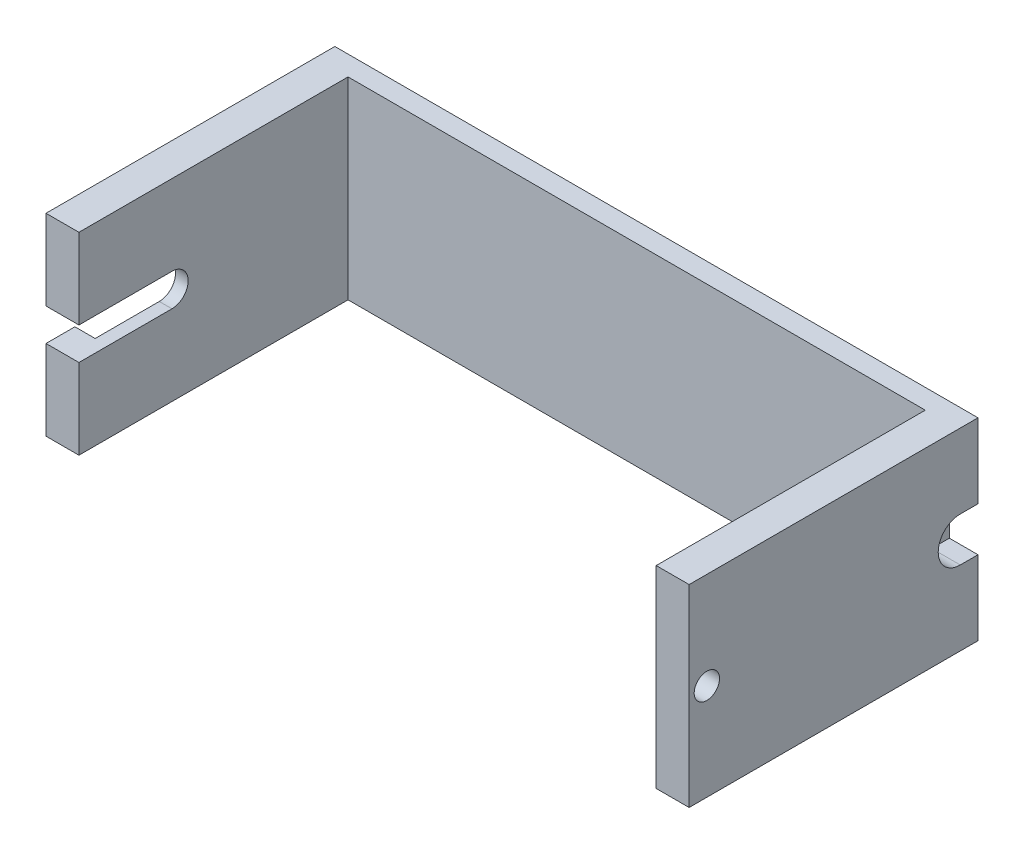
ISO-10303-21;
HEADER;
FILE_DESCRIPTION(('STEP AP214'),'2;1');
FILE_NAME('part.step','',(''),(''),'','','');
FILE_SCHEMA(('AUTOMOTIVE_DESIGN { 1 0 10303 214 1 1 1 1 }'));
ENDSEC;
DATA;
#1=APPLICATION_CONTEXT('core data for automotive mechanical design processes');
#2=APPLICATION_PROTOCOL_DEFINITION('international standard','automotive_design',2000,#1);
#3=PRODUCT_CONTEXT('',#1,'mechanical');
#4=PRODUCT('Part','Part','',(#3));
#5=PRODUCT_RELATED_PRODUCT_CATEGORY('part','',(#4));
#6=PRODUCT_DEFINITION_FORMATION('','',#4);
#7=PRODUCT_DEFINITION_CONTEXT('part definition',#1,'design');
#8=PRODUCT_DEFINITION('design','',#6,#7);
#9=PRODUCT_DEFINITION_SHAPE('','',#8);
#10=(LENGTH_UNIT() NAMED_UNIT(*) SI_UNIT(.MILLI.,.METRE.));
#11=(NAMED_UNIT(*) PLANE_ANGLE_UNIT() SI_UNIT($,.RADIAN.));
#12=(NAMED_UNIT(*) SI_UNIT($,.STERADIAN.) SOLID_ANGLE_UNIT());
#13=UNCERTAINTY_MEASURE_WITH_UNIT(LENGTH_MEASURE(1.E-05),#10,'distance_accuracy_value','');
#14=(GEOMETRIC_REPRESENTATION_CONTEXT(3) GLOBAL_UNCERTAINTY_ASSIGNED_CONTEXT((#13)) GLOBAL_UNIT_ASSIGNED_CONTEXT((#10,
#11,#12)) REPRESENTATION_CONTEXT('',''));
#15=CARTESIAN_POINT('',(0.,0.,0.));
#16=DIRECTION('',(0.,0.,1.));
#17=DIRECTION('',(1.,0.,0.));
#18=AXIS2_PLACEMENT_3D('',#15,#16,#17);
#19=CARTESIAN_POINT('',(0.,0.,57.));
#20=DIRECTION('',(0.,0.,1.));
#21=DIRECTION('',(1.,0.,0.));
#22=AXIS2_PLACEMENT_3D('',#19,#20,#21);
#23=PLANE('',#22);
#24=DIRECTION('',(-1.,0.,0.));
#25=VECTOR('',#24,1.);
#26=CARTESIAN_POINT('',(-76.9,22.25,57.));
#27=LINE('',#26,#25);
#28=CARTESIAN_POINT('',(-120.4,22.25,57.));
#29=VERTEX_POINT('',#28);
#30=CARTESIAN_POINT('',(-126.9,22.25,57.));
#31=VERTEX_POINT('',#30);
#32=EDGE_CURVE('E229',#29,#31,#27,.T.);
#33=ORIENTED_EDGE('',*,*,#32,.F.);
#34=DIRECTION('',(0.,1.,0.));
#35=VECTOR('',#34,1.);
#36=CARTESIAN_POINT('',(-120.4,38.1,57.));
#37=LINE('',#36,#35);
#38=CARTESIAN_POINT('',(-120.4,38.1,57.));
#39=VERTEX_POINT('',#38);
#40=EDGE_CURVE('E318',#29,#39,#37,.T.);
#41=ORIENTED_EDGE('',*,*,#40,.T.);
#42=DIRECTION('',(-1.,0.,0.));
#43=VECTOR('',#42,1.);
#44=CARTESIAN_POINT('',(-126.9,38.1,57.));
#45=LINE('',#44,#43);
#46=CARTESIAN_POINT('',(-126.9,38.1,57.));
#47=VERTEX_POINT('',#46);
#48=EDGE_CURVE('E322',#39,#47,#45,.T.);
#49=ORIENTED_EDGE('',*,*,#48,.T.);
#50=DIRECTION('',(0.,-1.,0.));
#51=VECTOR('',#50,1.);
#52=CARTESIAN_POINT('',(-126.9,38.1,57.));
#53=LINE('',#52,#51);
#54=EDGE_CURVE('E312',#47,#31,#53,.T.);
#55=ORIENTED_EDGE('',*,*,#54,.T.);
#56=EDGE_LOOP('',(#33,#41,#49,#55));
#57=FACE_BOUND('',#56,.T.);
#58=ADVANCED_FACE('F35',(#57),#23,.T.);
#59=CARTESIAN_POINT('',(-122.9,31.7,51.3));
#60=DIRECTION('',(0.,0.,1.));
#61=DIRECTION('',(1.,0.,0.));
#62=AXIS2_PLACEMENT_3D('',#59,#60,#61);
#63=PLANE('',#62);
#64=DIRECTION('',(0.,1.,0.));
#65=VECTOR('',#64,1.);
#66=CARTESIAN_POINT('',(-122.9,31.7,51.3));
#67=LINE('',#66,#65);
#68=CARTESIAN_POINT('',(-122.9,22.25,51.3));
#69=VERTEX_POINT('',#68);
#70=CARTESIAN_POINT('',(-122.9,31.7,51.3));
#71=VERTEX_POINT('',#70);
#72=EDGE_CURVE('E262',#69,#71,#67,.T.);
#73=ORIENTED_EDGE('',*,*,#72,.F.);
#74=DIRECTION('',(-1.,0.,0.));
#75=VECTOR('',#74,1.);
#76=CARTESIAN_POINT('',(-122.9,22.25,51.3));
#77=LINE('',#76,#75);
#78=CARTESIAN_POINT('',(-126.9,22.25,51.3));
#79=VERTEX_POINT('',#78);
#80=EDGE_CURVE('E246',#69,#79,#77,.T.);
#81=ORIENTED_EDGE('',*,*,#80,.T.);
#82=DIRECTION('',(0.,1.,0.));
#83=VECTOR('',#82,1.);
#84=CARTESIAN_POINT('',(-126.9,31.7,51.3));
#85=LINE('',#84,#83);
#86=CARTESIAN_POINT('',(-126.9,31.7,51.3));
#87=VERTEX_POINT('',#86);
#88=EDGE_CURVE('E257',#79,#87,#85,.T.);
#89=ORIENTED_EDGE('',*,*,#88,.T.);
#90=DIRECTION('',(-1.,0.,0.));
#91=VECTOR('',#90,1.);
#92=CARTESIAN_POINT('',(-122.9,31.7,51.3));
#93=LINE('',#92,#91);
#94=EDGE_CURVE('E271',#71,#87,#93,.T.);
#95=ORIENTED_EDGE('',*,*,#94,.F.);
#96=EDGE_LOOP('',(#73,#81,#89,#95));
#97=FACE_BOUND('',#96,.T.);
#98=ADVANCED_FACE('F417',(#97),#63,.F.);
#99=CARTESIAN_POINT('',(0.,0.,3.9));
#100=DIRECTION('',(0.,0.,1.));
#101=DIRECTION('',(1.,0.,0.));
#102=AXIS2_PLACEMENT_3D('',#99,#100,#101);
#103=PLANE('',#102);
#104=DIRECTION('',(1.,0.,0.));
#105=VECTOR('',#104,1.);
#106=CARTESIAN_POINT('',(0.,0.,3.9));
#107=LINE('',#106,#105);
#108=CARTESIAN_POINT('',(-120.4,0.,3.9));
#109=VERTEX_POINT('',#108);
#110=CARTESIAN_POINT('',(-6.5,0.,3.9));
#111=VERTEX_POINT('',#110);
#112=EDGE_CURVE('E336',#109,#111,#107,.T.);
#113=ORIENTED_EDGE('',*,*,#112,.T.);
#114=DIRECTION('',(0.,-1.,0.));
#115=VECTOR('',#114,1.);
#116=CARTESIAN_POINT('',(-6.5,38.1,3.9));
#117=LINE('',#116,#115);
#118=CARTESIAN_POINT('',(-6.5,38.1,3.9));
#119=VERTEX_POINT('',#118);
#120=EDGE_CURVE('E286',#119,#111,#117,.T.);
#121=ORIENTED_EDGE('',*,*,#120,.F.);
#122=DIRECTION('',(-1.,0.,0.));
#123=VECTOR('',#122,1.);
#124=CARTESIAN_POINT('',(0.,38.1,3.9));
#125=LINE('',#124,#123);
#126=CARTESIAN_POINT('',(-120.4,38.1,3.9));
#127=VERTEX_POINT('',#126);
#128=EDGE_CURVE('E334',#119,#127,#125,.T.);
#129=ORIENTED_EDGE('',*,*,#128,.T.);
#130=DIRECTION('',(0.,1.,0.));
#131=VECTOR('',#130,1.);
#132=CARTESIAN_POINT('',(-120.4,38.1,3.9));
#133=LINE('',#132,#131);
#134=EDGE_CURVE('E311',#109,#127,#133,.T.);
#135=ORIENTED_EDGE('',*,*,#134,.F.);
#136=EDGE_LOOP('',(#113,#121,#129,#135));
#137=FACE_BOUND('',#136,.T.);
#138=ADVANCED_FACE('F387',(#137),#103,.T.);
#139=CARTESIAN_POINT('',(0.,0.,3.9));
#140=DIRECTION('',(-1.,0.,0.));
#141=DIRECTION('',(0.,0.,1.));
#142=AXIS2_PLACEMENT_3D('',#139,#140,#141);
#143=PLANE('',#142);
#144=CARTESIAN_POINT('',(0.,19.05,53.5));
#145=DIRECTION('',(1.,0.,0.));
#146=DIRECTION('',(0.,0.,-1.));
#147=AXIS2_PLACEMENT_3D('',#144,#145,#146);
#148=CIRCLE('',#147,2.5);
#149=CARTESIAN_POINT('',(0.,19.05,51.));
#150=VERTEX_POINT('',#149);
#151=EDGE_CURVE('E210',#150,#150,#148,.T.);
#152=ORIENTED_EDGE('',*,*,#151,.F.);
#153=EDGE_LOOP('',(#152));
#154=FACE_BOUND('',#153,.T.);
#155=CARTESIAN_POINT('',(0.,19.05,3.5));
#156=DIRECTION('',(1.,0.,0.));
#157=DIRECTION('',(0.,0.,-1.));
#158=AXIS2_PLACEMENT_3D('',#155,#156,#157);
#159=CIRCLE('',#158,4.35);
#160=CARTESIAN_POINT('',(0.,23.4,3.5));
#161=VERTEX_POINT('',#160);
#162=CARTESIAN_POINT('',(0.,14.7,3.5));
#163=VERTEX_POINT('',#162);
#164=EDGE_CURVE('E191',#161,#163,#159,.T.);
#165=ORIENTED_EDGE('',*,*,#164,.F.);
#166=DIRECTION('',(0.,0.,1.));
#167=VECTOR('',#166,1.);
#168=CARTESIAN_POINT('',(0.,23.4,0.));
#169=LINE('',#168,#167);
#170=CARTESIAN_POINT('',(0.,23.4,0.));
#171=VERTEX_POINT('',#170);
#172=EDGE_CURVE('E204',#171,#161,#169,.T.);
#173=ORIENTED_EDGE('',*,*,#172,.F.);
#174=DIRECTION('',(0.,1.,0.));
#175=VECTOR('',#174,1.);
#176=CARTESIAN_POINT('',(0.,0.,0.));
#177=LINE('',#176,#175);
#178=CARTESIAN_POINT('',(0.,38.1,0.));
#179=VERTEX_POINT('',#178);
#180=EDGE_CURVE('E333',#171,#179,#177,.T.);
#181=ORIENTED_EDGE('',*,*,#180,.T.);
#182=DIRECTION('',(0.,0.,-1.));
#183=VECTOR('',#182,1.);
#184=CARTESIAN_POINT('',(0.,38.1,3.9));
#185=LINE('',#184,#183);
#186=CARTESIAN_POINT('',(0.,38.1,57.));
#187=VERTEX_POINT('',#186);
#188=EDGE_CURVE('E11',#187,#179,#185,.T.);
#189=ORIENTED_EDGE('',*,*,#188,.F.);
#190=DIRECTION('',(0.,1.,0.));
#191=VECTOR('',#190,1.);
#192=CARTESIAN_POINT('',(0.,38.1,57.));
#193=LINE('',#192,#191);
#194=CARTESIAN_POINT('',(0.,0.,57.));
#195=VERTEX_POINT('',#194);
#196=EDGE_CURVE('E293',#195,#187,#193,.T.);
#197=ORIENTED_EDGE('',*,*,#196,.F.);
#198=DIRECTION('',(0.,0.,-1.));
#199=VECTOR('',#198,1.);
#200=CARTESIAN_POINT('',(0.,0.,3.9));
#201=LINE('',#200,#199);
#202=CARTESIAN_POINT('',(0.,0.,0.));
#203=VERTEX_POINT('',#202);
#204=EDGE_CURVE('E339',#195,#203,#201,.T.);
#205=ORIENTED_EDGE('',*,*,#204,.T.);
#206=CARTESIAN_POINT('',(0.,14.7,0.));
#207=VERTEX_POINT('',#206);
#208=EDGE_CURVE('E340',#203,#207,#177,.T.);
#209=ORIENTED_EDGE('',*,*,#208,.T.);
#210=DIRECTION('',(0.,0.,-1.));
#211=VECTOR('',#210,1.);
#212=CARTESIAN_POINT('',(0.,14.7,3.5));
#213=LINE('',#212,#211);
#214=EDGE_CURVE('E207',#163,#207,#213,.T.);
#215=ORIENTED_EDGE('',*,*,#214,.F.);
#216=EDGE_LOOP('',(#165,#173,#181,#189,#197,#205,#209,#215));
#217=FACE_BOUND('',#216,.T.);
#218=ADVANCED_FACE('F37',(#154,#217),#143,.F.);
#219=CARTESIAN_POINT('',(0.,38.1,3.9));
#220=DIRECTION('',(0.,-1.,0.));
#221=DIRECTION('',(1.,0.,0.));
#222=AXIS2_PLACEMENT_3D('',#219,#220,#221);
#223=PLANE('',#222);
#224=DIRECTION('',(-1.,0.,0.));
#225=VECTOR('',#224,1.);
#226=CARTESIAN_POINT('',(0.,38.1,0.));
#227=LINE('',#226,#225);
#228=CARTESIAN_POINT('',(-126.9,38.1,0.));
#229=VERTEX_POINT('',#228);
#230=EDGE_CURVE('E343',#179,#229,#227,.T.);
#231=ORIENTED_EDGE('',*,*,#230,.T.);
#232=DIRECTION('',(0.,0.,-1.));
#233=VECTOR('',#232,1.);
#234=CARTESIAN_POINT('',(-126.9,38.1,3.9));
#235=LINE('',#234,#233);
#236=EDGE_CURVE('E44',#47,#229,#235,.T.);
#237=ORIENTED_EDGE('',*,*,#236,.F.);
#238=ORIENTED_EDGE('',*,*,#48,.F.);
#239=DIRECTION('',(0.,0.,-1.));
#240=VECTOR('',#239,1.);
#241=CARTESIAN_POINT('',(-120.4,38.1,57.));
#242=LINE('',#241,#240);
#243=EDGE_CURVE('E325',#39,#127,#242,.T.);
#244=ORIENTED_EDGE('',*,*,#243,.T.);
#245=ORIENTED_EDGE('',*,*,#128,.F.);
#246=DIRECTION('',(0.,0.,-1.));
#247=VECTOR('',#246,1.);
#248=CARTESIAN_POINT('',(-6.5,38.1,57.));
#249=LINE('',#248,#247);
#250=CARTESIAN_POINT('',(-6.5,38.1,57.));
#251=VERTEX_POINT('',#250);
#252=EDGE_CURVE('E308',#251,#119,#249,.T.);
#253=ORIENTED_EDGE('',*,*,#252,.F.);
#254=DIRECTION('',(-1.,0.,0.));
#255=VECTOR('',#254,1.);
#256=CARTESIAN_POINT('',(0.,38.1,57.));
#257=LINE('',#256,#255);
#258=EDGE_CURVE('E296',#187,#251,#257,.T.);
#259=ORIENTED_EDGE('',*,*,#258,.F.);
#260=ORIENTED_EDGE('',*,*,#188,.T.);
#261=EDGE_LOOP('',(#231,#237,#238,#244,#245,#253,#259,#260));
#262=FACE_BOUND('',#261,.T.);
#263=ADVANCED_FACE('F388',(#262),#223,.F.);
#264=CARTESIAN_POINT('',(-126.9,0.,3.9));
#265=DIRECTION('',(1.,0.,0.));
#266=DIRECTION('',(0.,0.,-1.));
#267=AXIS2_PLACEMENT_3D('',#264,#265,#266);
#268=PLANE('',#267);
#269=ORIENTED_EDGE('',*,*,#88,.F.);
#270=DIRECTION('',(0.,0.,-1.));
#271=VECTOR('',#270,1.);
#272=CARTESIAN_POINT('',(-126.9,22.25,38.65));
#273=LINE('',#272,#271);
#274=EDGE_CURVE('E223',#31,#79,#273,.T.);
#275=ORIENTED_EDGE('',*,*,#274,.F.);
#276=ORIENTED_EDGE('',*,*,#54,.F.);
#277=ORIENTED_EDGE('',*,*,#236,.T.);
#278=DIRECTION('',(0.,-1.,0.));
#279=VECTOR('',#278,1.);
#280=CARTESIAN_POINT('',(-126.9,0.,0.));
#281=LINE('',#280,#279);
#282=CARTESIAN_POINT('',(-126.9,0.,0.));
#283=VERTEX_POINT('',#282);
#284=EDGE_CURVE('E345',#229,#283,#281,.T.);
#285=ORIENTED_EDGE('',*,*,#284,.T.);
#286=DIRECTION('',(0.,0.,-1.));
#287=VECTOR('',#286,1.);
#288=CARTESIAN_POINT('',(-126.9,0.,3.9));
#289=LINE('',#288,#287);
#290=CARTESIAN_POINT('',(-126.9,0.,57.));
#291=VERTEX_POINT('',#290);
#292=EDGE_CURVE('E350',#291,#283,#289,.T.);
#293=ORIENTED_EDGE('',*,*,#292,.F.);
#294=CARTESIAN_POINT('',(-126.9,15.85,57.));
#295=VERTEX_POINT('',#294);
#296=EDGE_CURVE('E316',#295,#291,#53,.T.);
#297=ORIENTED_EDGE('',*,*,#296,.F.);
#298=DIRECTION('',(0.,0.,1.));
#299=VECTOR('',#298,1.);
#300=CARTESIAN_POINT('',(-126.9,15.85,57.));
#301=LINE('',#300,#299);
#302=CARTESIAN_POINT('',(-126.9,15.85,51.3));
#303=VERTEX_POINT('',#302);
#304=EDGE_CURVE('E218',#303,#295,#301,.T.);
#305=ORIENTED_EDGE('',*,*,#304,.F.);
#306=CARTESIAN_POINT('',(-126.9,6.4,51.3));
#307=VERTEX_POINT('',#306);
#308=EDGE_CURVE('E272',#307,#303,#85,.T.);
#309=ORIENTED_EDGE('',*,*,#308,.F.);
#310=DIRECTION('',(0.,0.,1.));
#311=VECTOR('',#310,1.);
#312=CARTESIAN_POINT('',(-126.9,6.4,51.3));
#313=LINE('',#312,#311);
#314=CARTESIAN_POINT('',(-126.9,6.4,26.));
#315=VERTEX_POINT('',#314);
#316=EDGE_CURVE('E281',#315,#307,#313,.T.);
#317=ORIENTED_EDGE('',*,*,#316,.F.);
#318=DIRECTION('',(0.,-1.,0.));
#319=VECTOR('',#318,1.);
#320=CARTESIAN_POINT('',(-126.9,31.7,26.));
#321=LINE('',#320,#319);
#322=CARTESIAN_POINT('',(-126.9,31.7,26.));
#323=VERTEX_POINT('',#322);
#324=EDGE_CURVE('E278',#323,#315,#321,.T.);
#325=ORIENTED_EDGE('',*,*,#324,.F.);
#326=DIRECTION('',(0.,0.,-1.));
#327=VECTOR('',#326,1.);
#328=CARTESIAN_POINT('',(-126.9,31.7,51.3));
#329=LINE('',#328,#327);
#330=EDGE_CURVE('E275',#87,#323,#329,.T.);
#331=ORIENTED_EDGE('',*,*,#330,.F.);
#332=EDGE_LOOP('',(#269,#275,#276,#277,#285,#293,#297,#305,#309,#317,#325,#331));
#333=FACE_BOUND('',#332,.T.);
#334=ADVANCED_FACE('F358',(#333),#268,.F.);
#335=CARTESIAN_POINT('',(0.,0.,3.9));
#336=DIRECTION('',(0.,1.,0.));
#337=DIRECTION('',(0.,0.,1.));
#338=AXIS2_PLACEMENT_3D('',#335,#336,#337);
#339=PLANE('',#338);
#340=DIRECTION('',(1.,0.,0.));
#341=VECTOR('',#340,1.);
#342=CARTESIAN_POINT('',(0.,0.,0.));
#343=LINE('',#342,#341);
#344=EDGE_CURVE('E337',#283,#203,#343,.T.);
#345=ORIENTED_EDGE('',*,*,#344,.T.);
#346=ORIENTED_EDGE('',*,*,#204,.F.);
#347=DIRECTION('',(1.,0.,0.));
#348=VECTOR('',#347,1.);
#349=CARTESIAN_POINT('',(0.,0.,57.));
#350=LINE('',#349,#348);
#351=CARTESIAN_POINT('',(-6.5,0.,57.));
#352=VERTEX_POINT('',#351);
#353=EDGE_CURVE('E300',#352,#195,#350,.T.);
#354=ORIENTED_EDGE('',*,*,#353,.F.);
#355=DIRECTION('',(0.,0.,-1.));
#356=VECTOR('',#355,1.);
#357=CARTESIAN_POINT('',(-6.5,0.,57.));
#358=LINE('',#357,#356);
#359=EDGE_CURVE('E303',#352,#111,#358,.T.);
#360=ORIENTED_EDGE('',*,*,#359,.T.);
#361=ORIENTED_EDGE('',*,*,#112,.F.);
#362=DIRECTION('',(0.,0.,-1.));
#363=VECTOR('',#362,1.);
#364=CARTESIAN_POINT('',(-120.4,0.,57.));
#365=LINE('',#364,#363);
#366=CARTESIAN_POINT('',(-120.4,0.,57.));
#367=VERTEX_POINT('',#366);
#368=EDGE_CURVE('E330',#367,#109,#365,.T.);
#369=ORIENTED_EDGE('',*,*,#368,.F.);
#370=DIRECTION('',(1.,0.,0.));
#371=VECTOR('',#370,1.);
#372=CARTESIAN_POINT('',(-126.9,0.,57.));
#373=LINE('',#372,#371);
#374=EDGE_CURVE('E315',#291,#367,#373,.T.);
#375=ORIENTED_EDGE('',*,*,#374,.F.);
#376=ORIENTED_EDGE('',*,*,#292,.T.);
#377=EDGE_LOOP('',(#345,#346,#354,#360,#361,#369,#375,#376));
#378=FACE_BOUND('',#377,.T.);
#379=ADVANCED_FACE('F370',(#378),#339,.F.);
#380=CARTESIAN_POINT('',(0.,0.,0.));
#381=DIRECTION('',(0.,0.,1.));
#382=DIRECTION('',(1.,0.,0.));
#383=AXIS2_PLACEMENT_3D('',#380,#381,#382);
#384=PLANE('',#383);
#385=ORIENTED_EDGE('',*,*,#180,.F.);
#386=DIRECTION('',(1.,0.,0.));
#387=VECTOR('',#386,1.);
#388=CARTESIAN_POINT('',(-5.65,23.4,0.));
#389=LINE('',#388,#387);
#390=CARTESIAN_POINT('',(-5.65,23.4,0.));
#391=VERTEX_POINT('',#390);
#392=EDGE_CURVE('E219',#391,#171,#389,.T.);
#393=ORIENTED_EDGE('',*,*,#392,.F.);
#394=DIRECTION('',(0.,1.,0.));
#395=VECTOR('',#394,1.);
#396=CARTESIAN_POINT('',(-5.65,14.7,0.));
#397=LINE('',#396,#395);
#398=CARTESIAN_POINT('',(-5.65,14.7,0.));
#399=VERTEX_POINT('',#398);
#400=EDGE_CURVE('E200',#399,#391,#397,.T.);
#401=ORIENTED_EDGE('',*,*,#400,.F.);
#402=DIRECTION('',(1.,0.,0.));
#403=VECTOR('',#402,1.);
#404=CARTESIAN_POINT('',(-5.65,14.7,0.));
#405=LINE('',#404,#403);
#406=EDGE_CURVE('E194',#399,#207,#405,.T.);
#407=ORIENTED_EDGE('',*,*,#406,.T.);
#408=ORIENTED_EDGE('',*,*,#208,.F.);
#409=ORIENTED_EDGE('',*,*,#344,.F.);
#410=ORIENTED_EDGE('',*,*,#284,.F.);
#411=ORIENTED_EDGE('',*,*,#230,.F.);
#412=EDGE_LOOP('',(#385,#393,#401,#407,#408,#409,#410,#411));
#413=FACE_BOUND('',#412,.T.);
#414=ADVANCED_FACE('F367',(#413),#384,.F.);
#415=CARTESIAN_POINT('',(-120.4,38.1,57.));
#416=DIRECTION('',(-1.,0.,0.));
#417=DIRECTION('',(0.,0.,1.));
#418=AXIS2_PLACEMENT_3D('',#415,#416,#417);
#419=PLANE('',#418);
#420=ORIENTED_EDGE('',*,*,#40,.F.);
#421=DIRECTION('',(0.,0.,-1.));
#422=VECTOR('',#421,1.);
#423=CARTESIAN_POINT('',(-120.4,22.25,57.));
#424=LINE('',#423,#422);
#425=CARTESIAN_POINT('',(-120.4,22.25,38.65));
#426=VERTEX_POINT('',#425);
#427=EDGE_CURVE('E249',#29,#426,#424,.T.);
#428=ORIENTED_EDGE('',*,*,#427,.T.);
#429=CARTESIAN_POINT('',(-120.4,19.05,38.65));
#430=DIRECTION('',(-1.,0.,0.));
#431=DIRECTION('',(0.,0.,1.));
#432=AXIS2_PLACEMENT_3D('',#429,#430,#431);
#433=CIRCLE('',#432,3.20000000000001);
#434=CARTESIAN_POINT('',(-120.4,15.85,38.65));
#435=VERTEX_POINT('',#434);
#436=EDGE_CURVE('E252',#426,#435,#433,.T.);
#437=ORIENTED_EDGE('',*,*,#436,.T.);
#438=DIRECTION('',(0.,0.,1.));
#439=VECTOR('',#438,1.);
#440=CARTESIAN_POINT('',(-120.4,15.85,57.));
#441=LINE('',#440,#439);
#442=CARTESIAN_POINT('',(-120.4,15.85,57.));
#443=VERTEX_POINT('',#442);
#444=EDGE_CURVE('E240',#435,#443,#441,.T.);
#445=ORIENTED_EDGE('',*,*,#444,.T.);
#446=EDGE_CURVE('E319',#367,#443,#37,.T.);
#447=ORIENTED_EDGE('',*,*,#446,.F.);
#448=ORIENTED_EDGE('',*,*,#368,.T.);
#449=ORIENTED_EDGE('',*,*,#134,.T.);
#450=ORIENTED_EDGE('',*,*,#243,.F.);
#451=EDGE_LOOP('',(#420,#428,#437,#445,#447,#448,#449,#450));
#452=FACE_BOUND('',#451,.T.);
#453=ADVANCED_FACE('F392',(#452),#419,.F.);
#454=DIRECTION('',(-1.,0.,0.));
#455=VECTOR('',#454,1.);
#456=CARTESIAN_POINT('',(-76.9,15.85,57.));
#457=LINE('',#456,#455);
#458=EDGE_CURVE('E231',#443,#295,#457,.T.);
#459=ORIENTED_EDGE('',*,*,#458,.T.);
#460=ORIENTED_EDGE('',*,*,#296,.T.);
#461=ORIENTED_EDGE('',*,*,#374,.T.);
#462=ORIENTED_EDGE('',*,*,#446,.T.);
#463=EDGE_LOOP('',(#459,#460,#461,#462));
#464=FACE_BOUND('',#463,.T.);
#465=ADVANCED_FACE('F395',(#464),#23,.T.);
#466=CARTESIAN_POINT('',(-6.5,38.1,57.));
#467=DIRECTION('',(1.,0.,0.));
#468=DIRECTION('',(0.,0.,-1.));
#469=AXIS2_PLACEMENT_3D('',#466,#467,#468);
#470=PLANE('',#469);
#471=CARTESIAN_POINT('',(-6.5,19.05,53.5));
#472=DIRECTION('',(1.,0.,0.));
#473=DIRECTION('',(0.,0.,-1.));
#474=AXIS2_PLACEMENT_3D('',#471,#472,#473);
#475=CIRCLE('',#474,2.5);
#476=CARTESIAN_POINT('',(-6.5,19.05,51.));
#477=VERTEX_POINT('',#476);
#478=EDGE_CURVE('E39',#477,#477,#475,.T.);
#479=ORIENTED_EDGE('',*,*,#478,.T.);
#480=EDGE_LOOP('',(#479));
#481=FACE_BOUND('',#480,.T.);
#482=ORIENTED_EDGE('',*,*,#120,.T.);
#483=ORIENTED_EDGE('',*,*,#359,.F.);
#484=DIRECTION('',(0.,-1.,0.));
#485=VECTOR('',#484,1.);
#486=CARTESIAN_POINT('',(-6.5,38.1,57.));
#487=LINE('',#486,#485);
#488=EDGE_CURVE('E298',#251,#352,#487,.T.);
#489=ORIENTED_EDGE('',*,*,#488,.F.);
#490=ORIENTED_EDGE('',*,*,#252,.T.);
#491=EDGE_LOOP('',(#482,#483,#489,#490));
#492=FACE_BOUND('',#491,.T.);
#493=ADVANCED_FACE('F384',(#481,#492),#470,.F.);
#494=CARTESIAN_POINT('',(0.,0.,57.));
#495=DIRECTION('',(0.,0.,-1.));
#496=DIRECTION('',(-1.,0.,0.));
#497=AXIS2_PLACEMENT_3D('',#494,#495,#496);
#498=PLANE('',#497);
#499=ORIENTED_EDGE('',*,*,#196,.T.);
#500=ORIENTED_EDGE('',*,*,#258,.T.);
#501=ORIENTED_EDGE('',*,*,#488,.T.);
#502=ORIENTED_EDGE('',*,*,#353,.T.);
#503=EDGE_LOOP('',(#499,#500,#501,#502));
#504=FACE_BOUND('',#503,.T.);
#505=ADVANCED_FACE('F377',(#504),#498,.F.);
#506=ORIENTED_EDGE('',*,*,#308,.T.);
#507=DIRECTION('',(1.,0.,0.));
#508=VECTOR('',#507,1.);
#509=CARTESIAN_POINT('',(-122.9,15.85,51.3));
#510=LINE('',#509,#508);
#511=CARTESIAN_POINT('',(-122.9,15.85,51.3));
#512=VERTEX_POINT('',#511);
#513=EDGE_CURVE('E237',#303,#512,#510,.T.);
#514=ORIENTED_EDGE('',*,*,#513,.T.);
#515=CARTESIAN_POINT('',(-122.9,6.4,51.3));
#516=VERTEX_POINT('',#515);
#517=EDGE_CURVE('E258',#516,#512,#67,.T.);
#518=ORIENTED_EDGE('',*,*,#517,.F.);
#519=DIRECTION('',(-1.,0.,0.));
#520=VECTOR('',#519,1.);
#521=CARTESIAN_POINT('',(-122.9,6.4,51.3));
#522=LINE('',#521,#520);
#523=EDGE_CURVE('E284',#516,#307,#522,.T.);
#524=ORIENTED_EDGE('',*,*,#523,.T.);
#525=EDGE_LOOP('',(#506,#514,#518,#524));
#526=FACE_BOUND('',#525,.T.);
#527=ADVANCED_FACE('F401',(#526),#63,.F.);
#528=CARTESIAN_POINT('',(-122.9,6.4,51.3));
#529=DIRECTION('',(0.,-1.,0.));
#530=DIRECTION('',(0.,0.,-1.));
#531=AXIS2_PLACEMENT_3D('',#528,#529,#530);
#532=PLANE('',#531);
#533=ORIENTED_EDGE('',*,*,#316,.T.);
#534=ORIENTED_EDGE('',*,*,#523,.F.);
#535=DIRECTION('',(0.,0.,1.));
#536=VECTOR('',#535,1.);
#537=CARTESIAN_POINT('',(-122.9,6.4,51.3));
#538=LINE('',#537,#536);
#539=CARTESIAN_POINT('',(-122.9,6.4,26.));
#540=VERTEX_POINT('',#539);
#541=EDGE_CURVE('E268',#540,#516,#538,.T.);
#542=ORIENTED_EDGE('',*,*,#541,.F.);
#543=DIRECTION('',(-1.,0.,0.));
#544=VECTOR('',#543,1.);
#545=CARTESIAN_POINT('',(-122.9,6.4,26.));
#546=LINE('',#545,#544);
#547=EDGE_CURVE('E287',#540,#315,#546,.T.);
#548=ORIENTED_EDGE('',*,*,#547,.T.);
#549=EDGE_LOOP('',(#533,#534,#542,#548));
#550=FACE_BOUND('',#549,.T.);
#551=ADVANCED_FACE('F405',(#550),#532,.F.);
#552=CARTESIAN_POINT('',(-122.9,31.7,26.));
#553=DIRECTION('',(0.,0.,-1.));
#554=DIRECTION('',(-1.,0.,0.));
#555=AXIS2_PLACEMENT_3D('',#552,#553,#554);
#556=PLANE('',#555);
#557=ORIENTED_EDGE('',*,*,#324,.T.);
#558=ORIENTED_EDGE('',*,*,#547,.F.);
#559=DIRECTION('',(0.,-1.,0.));
#560=VECTOR('',#559,1.);
#561=CARTESIAN_POINT('',(-122.9,31.7,26.));
#562=LINE('',#561,#560);
#563=CARTESIAN_POINT('',(-122.9,31.7,26.));
#564=VERTEX_POINT('',#563);
#565=EDGE_CURVE('E265',#564,#540,#562,.T.);
#566=ORIENTED_EDGE('',*,*,#565,.F.);
#567=DIRECTION('',(-1.,0.,0.));
#568=VECTOR('',#567,1.);
#569=CARTESIAN_POINT('',(-122.9,31.7,26.));
#570=LINE('',#569,#568);
#571=EDGE_CURVE('E289',#564,#323,#570,.T.);
#572=ORIENTED_EDGE('',*,*,#571,.T.);
#573=EDGE_LOOP('',(#557,#558,#566,#572));
#574=FACE_BOUND('',#573,.T.);
#575=ADVANCED_FACE('F409',(#574),#556,.F.);
#576=CARTESIAN_POINT('',(-122.9,31.7,51.3));
#577=DIRECTION('',(0.,1.,0.));
#578=DIRECTION('',(0.,0.,1.));
#579=AXIS2_PLACEMENT_3D('',#576,#577,#578);
#580=PLANE('',#579);
#581=ORIENTED_EDGE('',*,*,#330,.T.);
#582=ORIENTED_EDGE('',*,*,#571,.F.);
#583=DIRECTION('',(0.,0.,-1.));
#584=VECTOR('',#583,1.);
#585=CARTESIAN_POINT('',(-122.9,31.7,51.3));
#586=LINE('',#585,#584);
#587=EDGE_CURVE('E261',#71,#564,#586,.T.);
#588=ORIENTED_EDGE('',*,*,#587,.F.);
#589=ORIENTED_EDGE('',*,*,#94,.T.);
#590=EDGE_LOOP('',(#581,#582,#588,#589));
#591=FACE_BOUND('',#590,.T.);
#592=ADVANCED_FACE('F413',(#591),#580,.F.);
#593=CARTESIAN_POINT('',(-122.9,0.,0.));
#594=DIRECTION('',(1.,0.,0.));
#595=DIRECTION('',(0.,0.,-1.));
#596=AXIS2_PLACEMENT_3D('',#593,#594,#595);
#597=PLANE('',#596);
#598=CARTESIAN_POINT('',(-122.9,19.05,38.65));
#599=DIRECTION('',(-1.,0.,0.));
#600=DIRECTION('',(0.,0.,1.));
#601=AXIS2_PLACEMENT_3D('',#598,#599,#600);
#602=CIRCLE('',#601,3.2);
#603=CARTESIAN_POINT('',(-122.9,22.25,38.65));
#604=VERTEX_POINT('',#603);
#605=CARTESIAN_POINT('',(-122.9,15.85,38.65));
#606=VERTEX_POINT('',#605);
#607=EDGE_CURVE('E255',#604,#606,#602,.T.);
#608=ORIENTED_EDGE('',*,*,#607,.F.);
#609=DIRECTION('',(0.,0.,1.));
#610=VECTOR('',#609,1.);
#611=CARTESIAN_POINT('',(-122.9,22.25,0.));
#612=LINE('',#611,#610);
#613=EDGE_CURVE('E243',#604,#69,#612,.T.);
#614=ORIENTED_EDGE('',*,*,#613,.T.);
#615=ORIENTED_EDGE('',*,*,#72,.T.);
#616=ORIENTED_EDGE('',*,*,#587,.T.);
#617=ORIENTED_EDGE('',*,*,#565,.T.);
#618=ORIENTED_EDGE('',*,*,#541,.T.);
#619=ORIENTED_EDGE('',*,*,#517,.T.);
#620=DIRECTION('',(0.,0.,-1.));
#621=VECTOR('',#620,1.);
#622=CARTESIAN_POINT('',(-122.9,15.85,0.));
#623=LINE('',#622,#621);
#624=EDGE_CURVE('E228',#512,#606,#623,.T.);
#625=ORIENTED_EDGE('',*,*,#624,.T.);
#626=EDGE_LOOP('',(#608,#614,#615,#616,#617,#618,#619,#625));
#627=FACE_BOUND('',#626,.T.);
#628=ADVANCED_FACE('F427',(#627),#597,.F.);
#629=CARTESIAN_POINT('',(-76.9,19.05,38.65));
#630=DIRECTION('',(-1.,0.,0.));
#631=DIRECTION('',(0.,0.,1.));
#632=AXIS2_PLACEMENT_3D('',#629,#630,#631);
#633=CYLINDRICAL_SURFACE('',#632,3.20000000000001);
#634=DIRECTION('',(-1.,0.,0.));
#635=VECTOR('',#634,1.);
#636=CARTESIAN_POINT('',(-76.9,22.25,38.65));
#637=LINE('',#636,#635);
#638=EDGE_CURVE('E225',#426,#604,#637,.T.);
#639=ORIENTED_EDGE('',*,*,#638,.T.);
#640=ORIENTED_EDGE('',*,*,#607,.T.);
#641=DIRECTION('',(-1.,0.,0.));
#642=VECTOR('',#641,1.);
#643=CARTESIAN_POINT('',(-76.9,15.85,38.65));
#644=LINE('',#643,#642);
#645=EDGE_CURVE('E59',#435,#606,#644,.T.);
#646=ORIENTED_EDGE('',*,*,#645,.F.);
#647=ORIENTED_EDGE('',*,*,#436,.F.);
#648=EDGE_LOOP('',(#639,#640,#646,#647));
#649=FACE_BOUND('',#648,.T.);
#650=ADVANCED_FACE('F424',(#649),#633,.F.);
#651=CARTESIAN_POINT('',(-76.9,22.25,38.65));
#652=DIRECTION('',(0.,1.,0.));
#653=DIRECTION('',(0.,0.,1.));
#654=AXIS2_PLACEMENT_3D('',#651,#652,#653);
#655=PLANE('',#654);
#656=ORIENTED_EDGE('',*,*,#32,.T.);
#657=ORIENTED_EDGE('',*,*,#274,.T.);
#658=ORIENTED_EDGE('',*,*,#80,.F.);
#659=ORIENTED_EDGE('',*,*,#613,.F.);
#660=ORIENTED_EDGE('',*,*,#638,.F.);
#661=ORIENTED_EDGE('',*,*,#427,.F.);
#662=EDGE_LOOP('',(#656,#657,#658,#659,#660,#661));
#663=FACE_BOUND('',#662,.T.);
#664=ADVANCED_FACE('F421',(#663),#655,.F.);
#665=CARTESIAN_POINT('',(-76.9,15.85,57.));
#666=DIRECTION('',(0.,-1.,0.));
#667=DIRECTION('',(0.,0.,-1.));
#668=AXIS2_PLACEMENT_3D('',#665,#666,#667);
#669=PLANE('',#668);
#670=ORIENTED_EDGE('',*,*,#645,.T.);
#671=ORIENTED_EDGE('',*,*,#624,.F.);
#672=ORIENTED_EDGE('',*,*,#513,.F.);
#673=ORIENTED_EDGE('',*,*,#304,.T.);
#674=ORIENTED_EDGE('',*,*,#458,.F.);
#675=ORIENTED_EDGE('',*,*,#444,.F.);
#676=EDGE_LOOP('',(#670,#671,#672,#673,#674,#675));
#677=FACE_BOUND('',#676,.T.);
#678=ADVANCED_FACE('F428',(#677),#669,.F.);
#679=CARTESIAN_POINT('',(-5.65,19.05,3.5));
#680=DIRECTION('',(1.,0.,0.));
#681=DIRECTION('',(0.,0.,-1.));
#682=AXIS2_PLACEMENT_3D('',#679,#680,#681);
#683=CYLINDRICAL_SURFACE('',#682,4.35);
#684=ORIENTED_EDGE('',*,*,#164,.T.);
#685=DIRECTION('',(1.,0.,0.));
#686=VECTOR('',#685,1.);
#687=CARTESIAN_POINT('',(-5.65,14.7,3.5));
#688=LINE('',#687,#686);
#689=CARTESIAN_POINT('',(-5.65,14.7,3.5));
#690=VERTEX_POINT('',#689);
#691=EDGE_CURVE('E186',#690,#163,#688,.T.);
#692=ORIENTED_EDGE('',*,*,#691,.F.);
#693=CARTESIAN_POINT('',(-5.65,19.05,3.5));
#694=DIRECTION('',(1.,0.,0.));
#695=DIRECTION('',(0.,0.,-1.));
#696=AXIS2_PLACEMENT_3D('',#693,#694,#695);
#697=CIRCLE('',#696,4.35);
#698=CARTESIAN_POINT('',(-5.65,23.4,3.5));
#699=VERTEX_POINT('',#698);
#700=EDGE_CURVE('E188',#699,#690,#697,.T.);
#701=ORIENTED_EDGE('',*,*,#700,.F.);
#702=DIRECTION('',(1.,0.,0.));
#703=VECTOR('',#702,1.);
#704=CARTESIAN_POINT('',(-5.65,23.4,3.5));
#705=LINE('',#704,#703);
#706=EDGE_CURVE('E216',#699,#161,#705,.T.);
#707=ORIENTED_EDGE('',*,*,#706,.T.);
#708=EDGE_LOOP('',(#684,#692,#701,#707));
#709=FACE_BOUND('',#708,.T.);
#710=ADVANCED_FACE('F187',(#709),#683,.F.);
#711=CARTESIAN_POINT('',(-5.65,23.4,0.));
#712=DIRECTION('',(0.,1.,0.));
#713=DIRECTION('',(0.,0.,1.));
#714=AXIS2_PLACEMENT_3D('',#711,#712,#713);
#715=PLANE('',#714);
#716=ORIENTED_EDGE('',*,*,#172,.T.);
#717=ORIENTED_EDGE('',*,*,#706,.F.);
#718=DIRECTION('',(0.,0.,1.));
#719=VECTOR('',#718,1.);
#720=CARTESIAN_POINT('',(-5.65,23.4,0.));
#721=LINE('',#720,#719);
#722=EDGE_CURVE('E195',#391,#699,#721,.T.);
#723=ORIENTED_EDGE('',*,*,#722,.F.);
#724=ORIENTED_EDGE('',*,*,#392,.T.);
#725=EDGE_LOOP('',(#716,#717,#723,#724));
#726=FACE_BOUND('',#725,.T.);
#727=ADVANCED_FACE('F435',(#726),#715,.F.);
#728=CARTESIAN_POINT('',(-5.65,14.7,3.5));
#729=DIRECTION('',(0.,-1.,0.));
#730=DIRECTION('',(0.,0.,-1.));
#731=AXIS2_PLACEMENT_3D('',#728,#729,#730);
#732=PLANE('',#731);
#733=ORIENTED_EDGE('',*,*,#214,.T.);
#734=ORIENTED_EDGE('',*,*,#406,.F.);
#735=DIRECTION('',(0.,0.,-1.));
#736=VECTOR('',#735,1.);
#737=CARTESIAN_POINT('',(-5.65,14.7,3.5));
#738=LINE('',#737,#736);
#739=EDGE_CURVE('E51',#690,#399,#738,.T.);
#740=ORIENTED_EDGE('',*,*,#739,.F.);
#741=ORIENTED_EDGE('',*,*,#691,.T.);
#742=EDGE_LOOP('',(#733,#734,#740,#741));
#743=FACE_BOUND('',#742,.T.);
#744=ADVANCED_FACE('F197',(#743),#732,.F.);
#745=CARTESIAN_POINT('',(-5.65,19.05,3.5));
#746=DIRECTION('',(1.,0.,0.));
#747=DIRECTION('',(0.,0.,-1.));
#748=AXIS2_PLACEMENT_3D('',#745,#746,#747);
#749=PLANE('',#748);
#750=ORIENTED_EDGE('',*,*,#700,.T.);
#751=ORIENTED_EDGE('',*,*,#739,.T.);
#752=ORIENTED_EDGE('',*,*,#400,.T.);
#753=ORIENTED_EDGE('',*,*,#722,.T.);
#754=EDGE_LOOP('',(#750,#751,#752,#753));
#755=FACE_BOUND('',#754,.T.);
#756=ADVANCED_FACE('F202',(#755),#749,.T.);
#757=CARTESIAN_POINT('',(-10.,19.05,53.5));
#758=DIRECTION('',(1.,0.,0.));
#759=DIRECTION('',(0.,0.,-1.));
#760=AXIS2_PLACEMENT_3D('',#757,#758,#759);
#761=CYLINDRICAL_SURFACE('',#760,2.5);
#762=ORIENTED_EDGE('',*,*,#151,.T.);
#763=EDGE_LOOP('',(#762));
#764=FACE_BOUND('',#763,.T.);
#765=ORIENTED_EDGE('',*,*,#478,.F.);
#766=EDGE_LOOP('',(#765));
#767=FACE_BOUND('',#766,.T.);
#768=ADVANCED_FACE('F476',(#764,#767),#761,.F.);
#769=CLOSED_SHELL('',(#58,#98,#138,#218,#263,#334,#379,#414,#453,#465,#493,#505,#527,#551,#575,
#592,#628,#650,#664,#678,#710,#727,#744,#756,#768));
#770=MANIFOLD_SOLID_BREP('B2',#769);
#771=ADVANCED_BREP_SHAPE_REPRESENTATION('',(#18,#770),#14);
#772=SHAPE_DEFINITION_REPRESENTATION(#9,#771);
ENDSEC;
END-ISO-10303-21;
